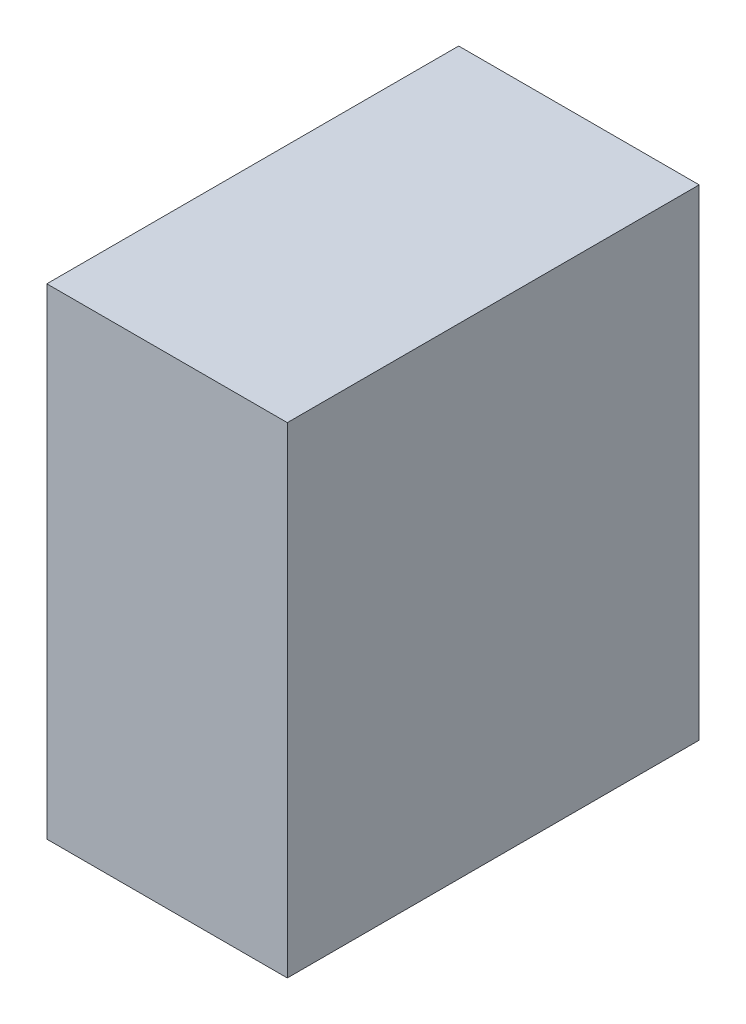
ISO-10303-21;
HEADER;
FILE_DESCRIPTION(('STEP AP214'),'2;1');
FILE_NAME('part.step','',(''),(''),'','','');
FILE_SCHEMA(('AUTOMOTIVE_DESIGN { 1 0 10303 214 1 1 1 1 }'));
ENDSEC;
DATA;
#1=APPLICATION_CONTEXT('core data for automotive mechanical design processes');
#2=APPLICATION_PROTOCOL_DEFINITION('international standard','automotive_design',2000,#1);
#3=PRODUCT_CONTEXT('',#1,'mechanical');
#4=PRODUCT('Part','Part','',(#3));
#5=PRODUCT_RELATED_PRODUCT_CATEGORY('part','',(#4));
#6=PRODUCT_DEFINITION_FORMATION('','',#4);
#7=PRODUCT_DEFINITION_CONTEXT('part definition',#1,'design');
#8=PRODUCT_DEFINITION('design','',#6,#7);
#9=PRODUCT_DEFINITION_SHAPE('','',#8);
#10=(LENGTH_UNIT() NAMED_UNIT(*) SI_UNIT(.MILLI.,.METRE.));
#11=(NAMED_UNIT(*) PLANE_ANGLE_UNIT() SI_UNIT($,.RADIAN.));
#12=(NAMED_UNIT(*) SI_UNIT($,.STERADIAN.) SOLID_ANGLE_UNIT());
#13=UNCERTAINTY_MEASURE_WITH_UNIT(LENGTH_MEASURE(1.E-05),#10,'distance_accuracy_value','');
#14=(GEOMETRIC_REPRESENTATION_CONTEXT(3) GLOBAL_UNCERTAINTY_ASSIGNED_CONTEXT((#13)) GLOBAL_UNIT_ASSIGNED_CONTEXT((#10,
#11,#12)) REPRESENTATION_CONTEXT('',''));
#15=CARTESIAN_POINT('',(0.,0.,0.));
#16=DIRECTION('',(0.,0.,1.));
#17=DIRECTION('',(1.,0.,0.));
#18=AXIS2_PLACEMENT_3D('',#15,#16,#17);
#19=CARTESIAN_POINT('',(-0.254,0.508,0.));
#20=DIRECTION('',(1.,0.,0.));
#21=DIRECTION('',(0.,0.,-1.));
#22=AXIS2_PLACEMENT_3D('',#19,#20,#21);
#23=PLANE('',#22);
#24=DIRECTION('',(0.,0.,1.));
#25=VECTOR('',#24,1.);
#26=CARTESIAN_POINT('',(-0.254,-0.508,0.));
#27=LINE('',#26,#25);
#28=CARTESIAN_POINT('',(-0.254,-0.508,0.));
#29=VERTEX_POINT('',#28);
#30=CARTESIAN_POINT('',(-0.254,-0.508,0.8700008));
#31=VERTEX_POINT('',#30);
#32=EDGE_CURVE('E20',#29,#31,#27,.T.);
#33=ORIENTED_EDGE('',*,*,#32,.T.);
#34=DIRECTION('',(0.,1.,0.));
#35=VECTOR('',#34,1.);
#36=CARTESIAN_POINT('',(-0.254,-0.508,0.8700008));
#37=LINE('',#36,#35);
#38=CARTESIAN_POINT('',(-0.254,0.508,0.8700008));
#39=VERTEX_POINT('',#38);
#40=EDGE_CURVE('E55',#31,#39,#37,.T.);
#41=ORIENTED_EDGE('',*,*,#40,.T.);
#42=DIRECTION('',(0.,0.,-1.));
#43=VECTOR('',#42,1.);
#44=CARTESIAN_POINT('',(-0.254,0.508,0.));
#45=LINE('',#44,#43);
#46=CARTESIAN_POINT('',(-0.254,0.508,0.));
#47=VERTEX_POINT('',#46);
#48=EDGE_CURVE('E74',#39,#47,#45,.T.);
#49=ORIENTED_EDGE('',*,*,#48,.T.);
#50=DIRECTION('',(0.,1.,0.));
#51=VECTOR('',#50,1.);
#52=CARTESIAN_POINT('',(-0.254,-0.508,0.));
#53=LINE('',#52,#51);
#54=EDGE_CURVE('E66',#29,#47,#53,.T.);
#55=ORIENTED_EDGE('',*,*,#54,.F.);
#56=EDGE_LOOP('',(#33,#41,#49,#55));
#57=FACE_BOUND('',#56,.T.);
#58=ADVANCED_FACE('F17',(#57),#23,.F.);
#59=CARTESIAN_POINT('',(-0.254,-0.508,0.));
#60=DIRECTION('',(0.,1.,0.));
#61=DIRECTION('',(0.,0.,1.));
#62=AXIS2_PLACEMENT_3D('',#59,#60,#61);
#63=PLANE('',#62);
#64=DIRECTION('',(0.,0.,1.));
#65=VECTOR('',#64,1.);
#66=CARTESIAN_POINT('',(0.254,-0.508,0.));
#67=LINE('',#66,#65);
#68=CARTESIAN_POINT('',(0.254,-0.508,0.));
#69=VERTEX_POINT('',#68);
#70=CARTESIAN_POINT('',(0.254,-0.508,0.8700008));
#71=VERTEX_POINT('',#70);
#72=EDGE_CURVE('E72',#69,#71,#67,.T.);
#73=ORIENTED_EDGE('',*,*,#72,.T.);
#74=DIRECTION('',(-1.,0.,0.));
#75=VECTOR('',#74,1.);
#76=CARTESIAN_POINT('',(-0.254,-0.508,0.8700008));
#77=LINE('',#76,#75);
#78=EDGE_CURVE('E62',#71,#31,#77,.T.);
#79=ORIENTED_EDGE('',*,*,#78,.T.);
#80=ORIENTED_EDGE('',*,*,#32,.F.);
#81=DIRECTION('',(-1.,0.,0.));
#82=VECTOR('',#81,1.);
#83=CARTESIAN_POINT('',(-0.254,-0.508,0.));
#84=LINE('',#83,#82);
#85=EDGE_CURVE('E80',#69,#29,#84,.T.);
#86=ORIENTED_EDGE('',*,*,#85,.F.);
#87=EDGE_LOOP('',(#73,#79,#80,#86));
#88=FACE_BOUND('',#87,.T.);
#89=ADVANCED_FACE('F71',(#88),#63,.F.);
#90=CARTESIAN_POINT('',(-0.254,-0.508,0.8700008));
#91=DIRECTION('',(0.,0.,-1.));
#92=DIRECTION('',(-1.,0.,0.));
#93=AXIS2_PLACEMENT_3D('',#90,#91,#92);
#94=PLANE('',#93);
#95=DIRECTION('',(0.,1.,0.));
#96=VECTOR('',#95,1.);
#97=CARTESIAN_POINT('',(0.254,-0.508,0.8700008));
#98=LINE('',#97,#96);
#99=CARTESIAN_POINT('',(0.254,0.508,0.8700008));
#100=VERTEX_POINT('',#99);
#101=EDGE_CURVE('E83',#71,#100,#98,.T.);
#102=ORIENTED_EDGE('',*,*,#101,.T.);
#103=DIRECTION('',(1.,0.,0.));
#104=VECTOR('',#103,1.);
#105=CARTESIAN_POINT('',(0.254,0.508,0.8700008));
#106=LINE('',#105,#104);
#107=EDGE_CURVE('E64',#100,#39,#106,.F.);
#108=ORIENTED_EDGE('',*,*,#107,.T.);
#109=ORIENTED_EDGE('',*,*,#40,.F.);
#110=ORIENTED_EDGE('',*,*,#78,.F.);
#111=EDGE_LOOP('',(#102,#108,#109,#110));
#112=FACE_BOUND('',#111,.T.);
#113=ADVANCED_FACE('F60',(#112),#94,.F.);
#114=CARTESIAN_POINT('',(0.254,0.508,0.));
#115=DIRECTION('',(0.,-1.,0.));
#116=DIRECTION('',(0.,0.,-1.));
#117=AXIS2_PLACEMENT_3D('',#114,#115,#116);
#118=PLANE('',#117);
#119=ORIENTED_EDGE('',*,*,#48,.F.);
#120=ORIENTED_EDGE('',*,*,#107,.F.);
#121=DIRECTION('',(0.,0.,1.));
#122=VECTOR('',#121,1.);
#123=CARTESIAN_POINT('',(0.254,0.508,0.));
#124=LINE('',#123,#122);
#125=CARTESIAN_POINT('',(0.254,0.508,0.));
#126=VERTEX_POINT('',#125);
#127=EDGE_CURVE('E26',#100,#126,#124,.F.);
#128=ORIENTED_EDGE('',*,*,#127,.T.);
#129=DIRECTION('',(-1.,0.,0.));
#130=VECTOR('',#129,1.);
#131=CARTESIAN_POINT('',(-0.254,0.508,0.));
#132=LINE('',#131,#130);
#133=EDGE_CURVE('E34',#47,#126,#132,.F.);
#134=ORIENTED_EDGE('',*,*,#133,.F.);
#135=EDGE_LOOP('',(#119,#120,#128,#134));
#136=FACE_BOUND('',#135,.T.);
#137=ADVANCED_FACE('F88',(#136),#118,.F.);
#138=CARTESIAN_POINT('',(-0.254,-0.508,0.));
#139=DIRECTION('',(0.,0.,-1.));
#140=DIRECTION('',(-1.,0.,0.));
#141=AXIS2_PLACEMENT_3D('',#138,#139,#140);
#142=PLANE('',#141);
#143=DIRECTION('',(0.,1.,0.));
#144=VECTOR('',#143,1.);
#145=CARTESIAN_POINT('',(0.254,-0.508,0.));
#146=LINE('',#145,#144);
#147=EDGE_CURVE('E11',#126,#69,#146,.F.);
#148=ORIENTED_EDGE('',*,*,#147,.T.);
#149=ORIENTED_EDGE('',*,*,#85,.T.);
#150=ORIENTED_EDGE('',*,*,#54,.T.);
#151=ORIENTED_EDGE('',*,*,#133,.T.);
#152=EDGE_LOOP('',(#148,#149,#150,#151));
#153=FACE_BOUND('',#152,.T.);
#154=ADVANCED_FACE('F91',(#153),#142,.T.);
#155=CARTESIAN_POINT('',(0.254,-0.508,0.));
#156=DIRECTION('',(-1.,0.,0.));
#157=DIRECTION('',(0.,0.,1.));
#158=AXIS2_PLACEMENT_3D('',#155,#156,#157);
#159=PLANE('',#158);
#160=ORIENTED_EDGE('',*,*,#127,.F.);
#161=ORIENTED_EDGE('',*,*,#101,.F.);
#162=ORIENTED_EDGE('',*,*,#72,.F.);
#163=ORIENTED_EDGE('',*,*,#147,.F.);
#164=EDGE_LOOP('',(#160,#161,#162,#163));
#165=FACE_BOUND('',#164,.T.);
#166=ADVANCED_FACE('F90',(#165),#159,.F.);
#167=CLOSED_SHELL('',(#58,#89,#113,#137,#154,#166));
#168=MANIFOLD_SOLID_BREP('B1',#167);
#169=ADVANCED_BREP_SHAPE_REPRESENTATION('',(#18,#168),#14);
#170=SHAPE_DEFINITION_REPRESENTATION(#9,#169);
ENDSEC;
END-ISO-10303-21;
